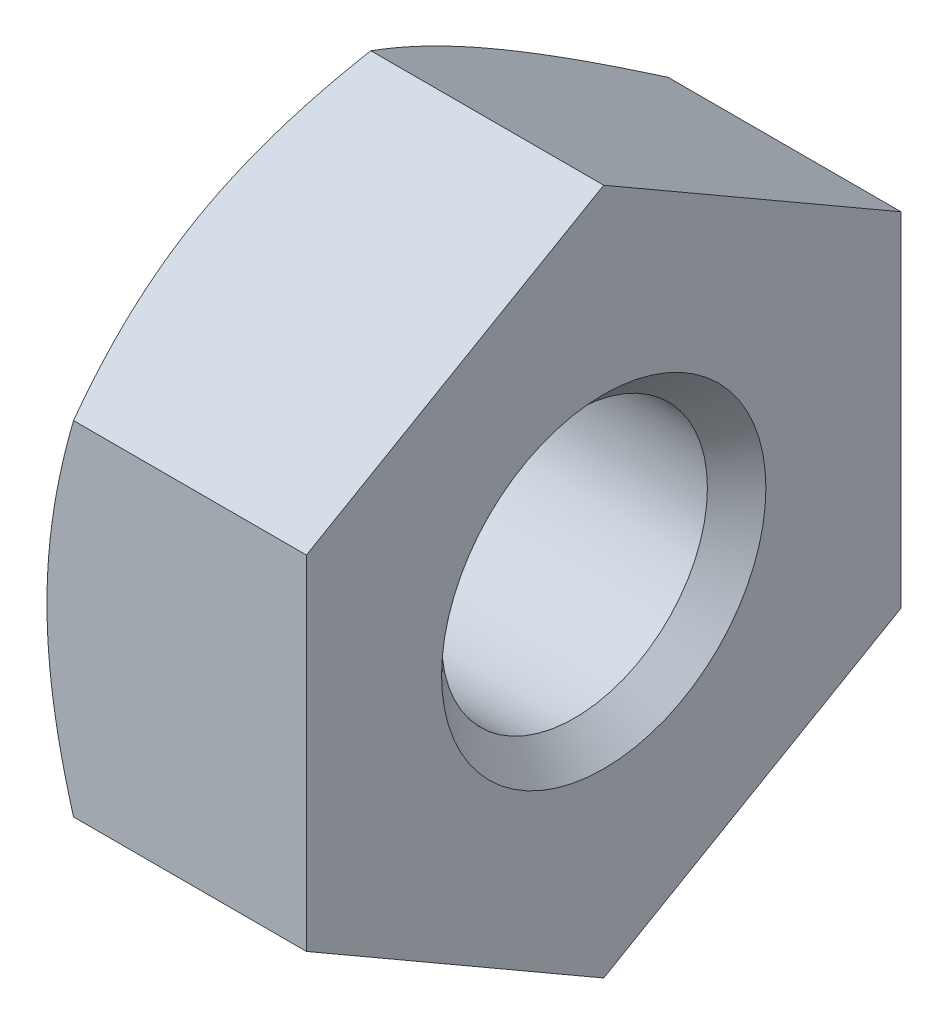
ISO-10303-21;
HEADER;
FILE_DESCRIPTION(('STEP AP214'),'2;1');
FILE_NAME('part.step','',(''),(''),'','','');
FILE_SCHEMA(('AUTOMOTIVE_DESIGN { 1 0 10303 214 1 1 1 1 }'));
ENDSEC;
DATA;
#1=APPLICATION_CONTEXT('core data for automotive mechanical design processes');
#2=APPLICATION_PROTOCOL_DEFINITION('international standard','automotive_design',2000,#1);
#3=PRODUCT_CONTEXT('',#1,'mechanical');
#4=PRODUCT('Part','Part','',(#3));
#5=PRODUCT_RELATED_PRODUCT_CATEGORY('part','',(#4));
#6=PRODUCT_DEFINITION_FORMATION('','',#4);
#7=PRODUCT_DEFINITION_CONTEXT('part definition',#1,'design');
#8=PRODUCT_DEFINITION('design','',#6,#7);
#9=PRODUCT_DEFINITION_SHAPE('','',#8);
#10=(LENGTH_UNIT() NAMED_UNIT(*) SI_UNIT(.MILLI.,.METRE.));
#11=(NAMED_UNIT(*) PLANE_ANGLE_UNIT() SI_UNIT($,.RADIAN.));
#12=(NAMED_UNIT(*) SI_UNIT($,.STERADIAN.) SOLID_ANGLE_UNIT());
#13=UNCERTAINTY_MEASURE_WITH_UNIT(LENGTH_MEASURE(1.E-05),#10,'distance_accuracy_value','');
#14=(GEOMETRIC_REPRESENTATION_CONTEXT(3) GLOBAL_UNCERTAINTY_ASSIGNED_CONTEXT((#13)) GLOBAL_UNIT_ASSIGNED_CONTEXT((#10,
#11,#12)) REPRESENTATION_CONTEXT('',''));
#15=CARTESIAN_POINT('',(0.,0.,0.));
#16=DIRECTION('',(0.,0.,1.));
#17=DIRECTION('',(1.,0.,0.));
#18=AXIS2_PLACEMENT_3D('',#15,#16,#17);
#19=CARTESIAN_POINT('',(-0.94019237886467,0.,0.));
#20=DIRECTION('',(1.,0.,0.));
#21=DIRECTION('',(0.,0.,-1.));
#22=AXIS2_PLACEMENT_3D('',#19,#20,#21);
#23=CONICAL_SURFACE('',#22,3.2,1.0471975511966);
#24=CARTESIAN_POINT('',(0.116899901263427,-4.2128176445144,-2.75));
#25=CARTESIAN_POINT('',(0.0585358150897928,-4.09206175441161,-2.75));
#26=CARTESIAN_POINT('',(0.000751313320708632,-3.97102058026674,-2.75));
#27=CARTESIAN_POINT('',(-0.11332737259427,-3.72821342104705,-2.75));
#28=CARTESIAN_POINT('',(-0.1696212991709,-3.60644731510048,-2.75));
#29=CARTESIAN_POINT('',(-0.280683816081055,-3.3613792497904,-2.75));
#30=CARTESIAN_POINT('',(-0.335441852528569,-3.23807249019038,-2.75));
#31=CARTESIAN_POINT('',(-0.442608769416106,-2.99044622504905,-2.75));
#32=CARTESIAN_POINT('',(-0.495017772139855,-2.86612677262461,-2.75));
#33=CARTESIAN_POINT('',(-0.597488011111556,-2.61472491435786,-2.75));
#34=CARTESIAN_POINT('',(-0.647512255717007,-2.48762734782283,-2.75));
#35=CARTESIAN_POINT('',(-0.743647769013464,-2.23193378863614,-2.75));
#36=CARTESIAN_POINT('',(-0.789758602600039,-2.10333763116981,-2.75));
#37=CARTESIAN_POINT('',(-0.876829746324347,-1.84470576670706,-2.75));
#38=CARTESIAN_POINT('',(-0.917800989357833,-1.71467377834625,-2.75));
#39=CARTESIAN_POINT('',(-0.993263613623143,-1.45276113270948,-2.75));
#40=CARTESIAN_POINT('',(-1.02775704200768,-1.32088107367671,-2.75));
#41=CARTESIAN_POINT('',(-1.08859053449044,-1.05518302145176,-2.75));
#42=CARTESIAN_POINT('',(-1.11492853241768,-0.921364546137669,-2.75));
#43=CARTESIAN_POINT('',(-1.15767953373874,-0.652112000043998,-2.75));
#44=CARTESIAN_POINT('',(-1.17409253050993,-0.51667792818645,-2.75));
#45=CARTESIAN_POINT('',(-1.19554160564382,-0.245762022708423,-2.75));
#46=CARTESIAN_POINT('',(-1.20064991451961,-0.110286056590175,-2.75));
#47=CARTESIAN_POINT('',(-1.1992173554919,0.160574270135581,-2.75));
#48=CARTESIAN_POINT('',(-1.19267952164877,0.295958645412523,-2.75));
#49=CARTESIAN_POINT('',(-1.17203672480029,0.527085181886233,-2.75));
#50=CARTESIAN_POINT('',(-1.16063339729711,0.623082191033736,-2.75));
#51=CARTESIAN_POINT('',(-1.13271188305182,0.81433598480462,-2.75));
#52=CARTESIAN_POINT('',(-1.1161928913043,0.909592650506843,-2.75));
#53=CARTESIAN_POINT('',(-1.059829209834,1.19417377130812,-2.75));
#54=CARTESIAN_POINT('',(-1.01319228175914,1.38216583216315,-2.75));
#55=CARTESIAN_POINT('',(-0.932739470552959,1.66347118298159,-2.75));
#56=CARTESIAN_POINT('',(-0.903761500041856,1.75825036010036,-2.75));
#57=CARTESIAN_POINT('',(-0.842933996229099,1.94681952572579,-2.75));
#58=CARTESIAN_POINT('',(-0.811086441961629,2.04061014688645,-2.75));
#59=CARTESIAN_POINT('',(-0.745182794916507,2.22681002484737,-2.75));
#60=CARTESIAN_POINT('',(-0.711140134891271,2.31922408448834,-2.75));
#61=CARTESIAN_POINT('',(-0.641053990054168,2.50333483778029,-2.75));
#62=CARTESIAN_POINT('',(-0.605009698237786,2.59503122483461,-2.75));
#63=CARTESIAN_POINT('',(-0.568162024521032,2.68639587514905,-2.75));
#64=B_SPLINE_CURVE_WITH_KNOTS('',3,(#24,#25,#26,#27,#28,#29,#30,#31,#32,#33,#34,#35,#36,#37,#38,
#39,#40,#41,#42,#43,#44,#45,#46,#47,#48,#49,#50,#51,#52,#53,#54,#55,#56,#57,#58,#59,#60,#61,#62,
#63),.UNSPECIFIED.,.F.,.F.,(4,2,2,2,2,2,2,2,2,2,2,2,2,2,2,2,2,2,2,4),(0.,0.402367371635709,
0.804803823938379,1.20953982216093,1.61425472649942,2.02396821262994,2.43372719238479,
2.8425991975322,3.2513417705758,3.6601878136146,4.06903412946197,4.47526051498547,
4.88138108563411,5.171255359401,5.46117527123616,6.0414458844777,6.33875257758383,
6.63585577731931,6.9312875346499,7.22683927936249),.UNSPECIFIED.);
#65=CARTESIAN_POINT('',(-1.2,0.,-2.75));
#66=VERTEX_POINT('',#65);
#67=CARTESIAN_POINT('',(-0.95437990693813,-1.5877132402715,-2.75));
#68=VERTEX_POINT('',#67);
#69=EDGE_CURVE('E208',#66,#68,#64,.F.);
#70=ORIENTED_EDGE('',*,*,#69,.T.);
#71=CARTESIAN_POINT('',(-0.954313236635232,-1.58759777021766,-2.7502));
#72=CARTESIAN_POINT('',(-0.99461233775073,-1.65737010029701,-2.62935077934009));
#73=CARTESIAN_POINT('',(-1.03126309740233,-1.72774469983536,-2.50745839737736));
#74=CARTESIAN_POINT('',(-1.0952378170302,-1.86971254687005,-2.2615628732721));
#75=CARTESIAN_POINT('',(-1.1225391443255,-1.94130831721585,-2.13755536142614));
#76=CARTESIAN_POINT('',(-1.16503825470588,-2.083612548896,-1.89107720202404));
#77=CARTESIAN_POINT('',(-1.18051888137754,-2.15429911309865,-1.76864448141257));
#78=CARTESIAN_POINT('',(-1.19900060263006,-2.29600490065924,-1.52320285763107));
#79=CARTESIAN_POINT('',(-1.2020170005374,-2.36702360884404,-1.40019484676707));
#80=CARTESIAN_POINT('',(-1.19574685457146,-2.49972966594897,-1.17034121338919));
#81=CARTESIAN_POINT('',(-1.1879998457233,-2.56143686540072,-1.06346120874596));
#82=CARTESIAN_POINT('',(-1.16344481893565,-2.68444923614045,-0.850397532665236));
#83=CARTESIAN_POINT('',(-1.14662841034944,-2.74575398185006,-0.744214598351098));
#84=CARTESIAN_POINT('',(-1.10458807765406,-2.86902004703204,-0.530711510606808));
#85=CARTESIAN_POINT('',(-1.07918591931279,-2.93096576264316,-0.423418383857138));
#86=CARTESIAN_POINT('',(-1.02153277416004,-3.0539332080613,-0.210432520715946));
#87=CARTESIAN_POINT('',(-0.98929533670104,-3.11495651365991,-0.104737054973346));
#88=CARTESIAN_POINT('',(-0.954313236635265,-3.17554195059674,0.000199999999999926));
#89=B_SPLINE_CURVE_WITH_KNOTS('',3,(#71,#72,#73,#74,#75,#76,#77,#78,#79,#80,#81,#82,#83,#84,#85,
#86,#87,#88),.UNSPECIFIED.,.F.,.F.,(4,2,2,2,2,2,2,2,4),(0.,0.43591282872589,0.872873557116336,
1.29901931904672,1.72464171213574,2.09526089052937,2.46622354066373,2.84541551798555,
3.22386274754521),.UNSPECIFIED.);
#90=CARTESIAN_POINT('',(-1.2,-2.38156986040723,-1.37499999999995));
#91=VERTEX_POINT('',#90);
#92=EDGE_CURVE('E11',#68,#91,#89,.T.);
#93=ORIENTED_EDGE('',*,*,#92,.T.);
#94=CARTESIAN_POINT('',(-1.2,0.,0.));
#95=DIRECTION('',(-1.,0.,0.));
#96=DIRECTION('',(0.,0.,1.));
#97=AXIS2_PLACEMENT_3D('',#94,#95,#96);
#98=CIRCLE('',#97,2.75);
#99=EDGE_CURVE('E254',#66,#91,#98,.T.);
#100=ORIENTED_EDGE('',*,*,#99,.F.);
#101=EDGE_LOOP('',(#70,#93,#100));
#102=FACE_BOUND('',#101,.T.);
#103=ADVANCED_FACE('F35',(#102),#23,.T.);
#104=CARTESIAN_POINT('',(-1.2,-2.38156986040723,1.37499999999995));
#105=VERTEX_POINT('',#104);
#106=EDGE_CURVE('E260',#91,#105,#98,.T.);
#107=ORIENTED_EDGE('',*,*,#106,.F.);
#108=CARTESIAN_POINT('',(-0.954379906938163,-3.1754264805429,0.));
#109=VERTEX_POINT('',#108);
#110=EDGE_CURVE('E39',#91,#109,#89,.T.);
#111=ORIENTED_EDGE('',*,*,#110,.T.);
#112=CARTESIAN_POINT('',(-0.954313236635265,-3.17554195059674,-0.00019999999999989));
#113=CARTESIAN_POINT('',(-0.99461233775076,-3.10576962051739,0.120649220659906));
#114=CARTESIAN_POINT('',(-1.03126309740236,-3.03539502097904,0.242541602622634));
#115=CARTESIAN_POINT('',(-1.09523781703022,-2.89342717394436,0.488437126727893));
#116=CARTESIAN_POINT('',(-1.12253914432552,-2.82183140359856,0.612444638573856));
#117=CARTESIAN_POINT('',(-1.16503825470589,-2.6795271719184,0.858922797975944));
#118=CARTESIAN_POINT('',(-1.18051888137755,-2.60884060771575,0.981355518587418));
#119=CARTESIAN_POINT('',(-1.19900060263007,-2.46713482015518,1.22679714236892));
#120=CARTESIAN_POINT('',(-1.2020170005374,-2.39611611197037,1.34980515323291));
#121=CARTESIAN_POINT('',(-1.19574685457145,-2.26341005486544,1.57965878661079));
#122=CARTESIAN_POINT('',(-1.1879998457233,-2.20170285541369,1.68653879125402));
#123=CARTESIAN_POINT('',(-1.16344481893564,-2.07869048467395,1.89960246733475));
#124=CARTESIAN_POINT('',(-1.14662841034943,-2.01738573896434,2.00578540164889));
#125=CARTESIAN_POINT('',(-1.10458807765404,-1.89411967378236,2.21928848939318));
#126=CARTESIAN_POINT('',(-1.07918591931276,-1.83217395817125,2.32658161614285));
#127=CARTESIAN_POINT('',(-1.02153277416001,-1.7092065127531,2.53956747928405));
#128=CARTESIAN_POINT('',(-0.98929533670101,-1.64818320715449,2.64526294502665));
#129=CARTESIAN_POINT('',(-0.954313236635232,-1.58759777021766,2.7502));
#130=B_SPLINE_CURVE_WITH_KNOTS('',3,(#112,#113,#114,#115,#116,#117,#118,#119,#120,#121,#122,
#123,#124,#125,#126,#127,#128,#129),.UNSPECIFIED.,.F.,.F.,(4,2,2,2,2,2,2,2,4),(0.,
0.435912828725883,0.87287355711632,1.2990193190467,1.72464171213571,2.09526089052935,
2.46622354066371,2.84541551798554,3.22386274754521),.UNSPECIFIED.);
#131=EDGE_CURVE('E217',#109,#105,#130,.T.);
#132=ORIENTED_EDGE('',*,*,#131,.T.);
#133=EDGE_LOOP('',(#107,#111,#132));
#134=FACE_BOUND('',#133,.T.);
#135=ADVANCED_FACE('F243',(#134),#23,.T.);
#136=CARTESIAN_POINT('',(-1.2,0.,2.75));
#137=VERTEX_POINT('',#136);
#138=EDGE_CURVE('E163',#105,#137,#98,.T.);
#139=ORIENTED_EDGE('',*,*,#138,.F.);
#140=CARTESIAN_POINT('',(-0.95437990693813,-1.5877132402715,2.75));
#141=VERTEX_POINT('',#140);
#142=EDGE_CURVE('E206',#105,#141,#130,.T.);
#143=ORIENTED_EDGE('',*,*,#142,.T.);
#144=CARTESIAN_POINT('',(0.116899901263427,-4.2128176445144,2.75));
#145=CARTESIAN_POINT('',(0.0585358150897928,-4.09206175441161,2.75));
#146=CARTESIAN_POINT('',(0.000751313320708632,-3.97102058026674,2.75));
#147=CARTESIAN_POINT('',(-0.11332737259427,-3.72821342104705,2.75));
#148=CARTESIAN_POINT('',(-0.1696212991709,-3.60644731510048,2.75));
#149=CARTESIAN_POINT('',(-0.280683816081055,-3.3613792497904,2.75));
#150=CARTESIAN_POINT('',(-0.335441852528569,-3.23807249019038,2.75));
#151=CARTESIAN_POINT('',(-0.442608769416106,-2.99044622504905,2.75));
#152=CARTESIAN_POINT('',(-0.495017772139855,-2.86612677262461,2.75));
#153=CARTESIAN_POINT('',(-0.597488011111556,-2.61472491435786,2.75));
#154=CARTESIAN_POINT('',(-0.647512255717007,-2.48762734782283,2.75));
#155=CARTESIAN_POINT('',(-0.743647769013464,-2.23193378863614,2.75));
#156=CARTESIAN_POINT('',(-0.789758602600039,-2.10333763116981,2.75));
#157=CARTESIAN_POINT('',(-0.876829746324347,-1.84470576670706,2.75));
#158=CARTESIAN_POINT('',(-0.917800989357833,-1.71467377834625,2.75));
#159=CARTESIAN_POINT('',(-0.993263613623143,-1.45276113270948,2.75));
#160=CARTESIAN_POINT('',(-1.02775704200768,-1.32088107367671,2.75));
#161=CARTESIAN_POINT('',(-1.08859053449044,-1.05518302145176,2.75));
#162=CARTESIAN_POINT('',(-1.11492853241768,-0.921364546137669,2.75));
#163=CARTESIAN_POINT('',(-1.15767953373874,-0.652112000043998,2.75));
#164=CARTESIAN_POINT('',(-1.17409253050993,-0.51667792818645,2.75));
#165=CARTESIAN_POINT('',(-1.19554160564382,-0.245762022708423,2.75));
#166=CARTESIAN_POINT('',(-1.20064991451961,-0.110286056590175,2.75));
#167=CARTESIAN_POINT('',(-1.1992173554919,0.160574270135581,2.75));
#168=CARTESIAN_POINT('',(-1.19267952164877,0.295958645412523,2.75));
#169=CARTESIAN_POINT('',(-1.17203672480029,0.527085181886233,2.75));
#170=CARTESIAN_POINT('',(-1.16063339729711,0.623082191033736,2.75));
#171=CARTESIAN_POINT('',(-1.13271188305182,0.81433598480462,2.75));
#172=CARTESIAN_POINT('',(-1.1161928913043,0.909592650506843,2.75));
#173=CARTESIAN_POINT('',(-1.059829209834,1.19417377130812,2.75));
#174=CARTESIAN_POINT('',(-1.01319228175914,1.38216583216315,2.75));
#175=CARTESIAN_POINT('',(-0.932739470552959,1.66347118298159,2.75));
#176=CARTESIAN_POINT('',(-0.903761500041856,1.75825036010036,2.75));
#177=CARTESIAN_POINT('',(-0.842933996229099,1.94681952572579,2.75));
#178=CARTESIAN_POINT('',(-0.811086441961629,2.04061014688645,2.75));
#179=CARTESIAN_POINT('',(-0.745182794916507,2.22681002484737,2.75));
#180=CARTESIAN_POINT('',(-0.711140134891271,2.31922408448834,2.75));
#181=CARTESIAN_POINT('',(-0.641053990054168,2.50333483778029,2.75));
#182=CARTESIAN_POINT('',(-0.605009698237786,2.59503122483461,2.75));
#183=CARTESIAN_POINT('',(-0.568162024521032,2.68639587514905,2.75));
#184=B_SPLINE_CURVE_WITH_KNOTS('',3,(#144,#145,#146,#147,#148,#149,#150,#151,#152,#153,#154,
#155,#156,#157,#158,#159,#160,#161,#162,#163,#164,#165,#166,#167,#168,#169,#170,#171,#172,#173,
#174,#175,#176,#177,#178,#179,#180,#181,#182,#183),.UNSPECIFIED.,.F.,.F.,(4,2,2,2,2,2,2,2,2,2,2,
2,2,2,2,2,2,2,2,4),(0.,0.402367371635709,0.804803823938379,1.20953982216093,1.61425472649942,
2.02396821262994,2.43372719238479,2.8425991975322,3.2513417705758,3.6601878136146,
4.06903412946197,4.47526051498547,4.88138108563411,5.171255359401,5.46117527123616,
6.0414458844777,6.33875257758383,6.63585577731931,6.9312875346499,7.22683927936249),.UNSPECIFIED.);
#185=EDGE_CURVE('E113',#141,#137,#184,.T.);
#186=ORIENTED_EDGE('',*,*,#185,.T.);
#187=EDGE_LOOP('',(#139,#143,#186));
#188=FACE_BOUND('',#187,.T.);
#189=ADVANCED_FACE('F248',(#188),#23,.T.);
#190=CARTESIAN_POINT('',(-0.954313236635265,3.17554195059674,0.00019999999999989));
#191=CARTESIAN_POINT('',(-0.99461233775076,3.10576962051739,-0.120649220659906));
#192=CARTESIAN_POINT('',(-1.03126309740236,3.03539502097904,-0.242541602622634));
#193=CARTESIAN_POINT('',(-1.09523781703022,2.89342717394436,-0.488437126727893));
#194=CARTESIAN_POINT('',(-1.12253914432552,2.82183140359856,-0.612444638573856));
#195=CARTESIAN_POINT('',(-1.16503825470589,2.6795271719184,-0.858922797975944));
#196=CARTESIAN_POINT('',(-1.18051888137755,2.60884060771575,-0.981355518587418));
#197=CARTESIAN_POINT('',(-1.19900060263007,2.46713482015518,-1.22679714236892));
#198=CARTESIAN_POINT('',(-1.2020170005374,2.39611611197037,-1.34980515323291));
#199=CARTESIAN_POINT('',(-1.19574685457145,2.26341005486544,-1.57965878661079));
#200=CARTESIAN_POINT('',(-1.1879998457233,2.20170285541369,-1.68653879125402));
#201=CARTESIAN_POINT('',(-1.16344481893564,2.07869048467395,-1.89960246733475));
#202=CARTESIAN_POINT('',(-1.14662841034943,2.01738573896434,-2.00578540164889));
#203=CARTESIAN_POINT('',(-1.10458807765404,1.89411967378236,-2.21928848939318));
#204=CARTESIAN_POINT('',(-1.07918591931276,1.83217395817125,-2.32658161614285));
#205=CARTESIAN_POINT('',(-1.02153277416001,1.7092065127531,-2.53956747928405));
#206=CARTESIAN_POINT('',(-0.98929533670101,1.64818320715449,-2.64526294502665));
#207=CARTESIAN_POINT('',(-0.954313236635232,1.58759777021766,-2.7502));
#208=B_SPLINE_CURVE_WITH_KNOTS('',3,(#190,#191,#192,#193,#194,#195,#196,#197,#198,#199,#200,
#201,#202,#203,#204,#205,#206,#207),.UNSPECIFIED.,.F.,.F.,(4,2,2,2,2,2,2,2,4),(0.,
0.435912828725883,0.87287355711632,1.2990193190467,1.72464171213571,2.09526089052935,
2.46622354066371,2.84541551798554,3.22386274754521),.UNSPECIFIED.);
#209=CARTESIAN_POINT('',(-1.2,2.38156986040723,-1.37499999999995));
#210=VERTEX_POINT('',#209);
#211=CARTESIAN_POINT('',(-0.95437990693813,1.5877132402715,-2.75));
#212=VERTEX_POINT('',#211);
#213=EDGE_CURVE('E207',#210,#212,#208,.T.);
#214=ORIENTED_EDGE('',*,*,#213,.T.);
#215=EDGE_CURVE('E201',#212,#66,#64,.F.);
#216=ORIENTED_EDGE('',*,*,#215,.T.);
#217=EDGE_CURVE('E265',#210,#66,#98,.T.);
#218=ORIENTED_EDGE('',*,*,#217,.F.);
#219=EDGE_LOOP('',(#214,#216,#218));
#220=FACE_BOUND('',#219,.T.);
#221=ADVANCED_FACE('F272',(#220),#23,.T.);
#222=CARTESIAN_POINT('',(-1.2,2.38156986040723,1.37499999999995));
#223=VERTEX_POINT('',#222);
#224=EDGE_CURVE('E164',#137,#223,#98,.T.);
#225=ORIENTED_EDGE('',*,*,#224,.F.);
#226=CARTESIAN_POINT('',(-0.95437990693813,1.5877132402715,2.75));
#227=VERTEX_POINT('',#226);
#228=EDGE_CURVE('E209',#137,#227,#184,.T.);
#229=ORIENTED_EDGE('',*,*,#228,.T.);
#230=CARTESIAN_POINT('',(-0.954313236635232,1.58759777021766,2.7502));
#231=CARTESIAN_POINT('',(-0.99461233775073,1.65737010029701,2.62935077934009));
#232=CARTESIAN_POINT('',(-1.03126309740233,1.72774469983536,2.50745839737736));
#233=CARTESIAN_POINT('',(-1.0952378170302,1.86971254687005,2.2615628732721));
#234=CARTESIAN_POINT('',(-1.1225391443255,1.94130831721585,2.13755536142614));
#235=CARTESIAN_POINT('',(-1.16503825470588,2.083612548896,1.89107720202404));
#236=CARTESIAN_POINT('',(-1.18051888137754,2.15429911309865,1.76864448141257));
#237=CARTESIAN_POINT('',(-1.19900060263006,2.29600490065924,1.52320285763107));
#238=CARTESIAN_POINT('',(-1.2020170005374,2.36702360884404,1.40019484676707));
#239=CARTESIAN_POINT('',(-1.19574685457146,2.49972966594897,1.17034121338919));
#240=CARTESIAN_POINT('',(-1.1879998457233,2.56143686540072,1.06346120874596));
#241=CARTESIAN_POINT('',(-1.16344481893565,2.68444923614045,0.850397532665236));
#242=CARTESIAN_POINT('',(-1.14662841034944,2.74575398185006,0.744214598351098));
#243=CARTESIAN_POINT('',(-1.10458807765406,2.86902004703204,0.530711510606808));
#244=CARTESIAN_POINT('',(-1.07918591931279,2.93096576264316,0.423418383857138));
#245=CARTESIAN_POINT('',(-1.02153277416004,3.0539332080613,0.210432520715946));
#246=CARTESIAN_POINT('',(-0.98929533670104,3.11495651365991,0.104737054973346));
#247=CARTESIAN_POINT('',(-0.954313236635265,3.17554195059674,-0.000199999999999926));
#248=B_SPLINE_CURVE_WITH_KNOTS('',3,(#230,#231,#232,#233,#234,#235,#236,#237,#238,#239,#240,
#241,#242,#243,#244,#245,#246,#247),.UNSPECIFIED.,.F.,.F.,(4,2,2,2,2,2,2,2,4),(0.,
0.43591282872589,0.872873557116336,1.29901931904672,1.72464171213574,2.09526089052937,
2.46622354066373,2.84541551798555,3.22386274754521),.UNSPECIFIED.);
#249=EDGE_CURVE('E175',#227,#223,#248,.T.);
#250=ORIENTED_EDGE('',*,*,#249,.T.);
#251=EDGE_LOOP('',(#225,#229,#250));
#252=FACE_BOUND('',#251,.T.);
#253=ADVANCED_FACE('F240',(#252),#23,.T.);
#254=CARTESIAN_POINT('',(-1.2,0.,0.));
#255=DIRECTION('',(1.,0.,0.));
#256=DIRECTION('',(0.,0.,-1.));
#257=AXIS2_PLACEMENT_3D('',#254,#255,#256);
#258=PLANE('',#257);
#259=ORIENTED_EDGE('',*,*,#224,.T.);
#260=EDGE_CURVE('E168',#223,#210,#98,.T.);
#261=ORIENTED_EDGE('',*,*,#260,.T.);
#262=ORIENTED_EDGE('',*,*,#217,.T.);
#263=ORIENTED_EDGE('',*,*,#99,.T.);
#264=ORIENTED_EDGE('',*,*,#106,.T.);
#265=ORIENTED_EDGE('',*,*,#138,.T.);
#266=EDGE_LOOP('',(#259,#261,#262,#263,#264,#265));
#267=FACE_BOUND('',#266,.T.);
#268=CARTESIAN_POINT('',(-1.2,0.,0.));
#269=DIRECTION('',(-1.,0.,0.));
#270=DIRECTION('',(0.,0.,1.));
#271=AXIS2_PLACEMENT_3D('',#268,#269,#270);
#272=CIRCLE('',#271,1.5);
#273=CARTESIAN_POINT('',(-1.2,0.,1.5));
#274=VERTEX_POINT('',#273);
#275=EDGE_CURVE('E160',#274,#274,#272,.T.);
#276=ORIENTED_EDGE('',*,*,#275,.F.);
#277=EDGE_LOOP('',(#276));
#278=FACE_BOUND('',#277,.T.);
#279=ADVANCED_FACE('F37',(#267,#278),#258,.F.);
#280=CARTESIAN_POINT('',(1.2,3.2,0.));
#281=DIRECTION('',(-1.,0.,0.));
#282=DIRECTION('',(0.,0.,1.));
#283=AXIS2_PLACEMENT_3D('',#280,#281,#282);
#284=PLANE('',#283);
#285=DIRECTION('',(0.,-0.499999999999983,0.866025403784448));
#286=VECTOR('',#285,1.);
#287=CARTESIAN_POINT('',(1.2,3.1754264805429,0.));
#288=LINE('',#287,#286);
#289=CARTESIAN_POINT('',(1.2,3.1754264805429,0.));
#290=VERTEX_POINT('',#289);
#291=CARTESIAN_POINT('',(1.2,1.5877132402715,2.75));
#292=VERTEX_POINT('',#291);
#293=EDGE_CURVE('E132',#290,#292,#288,.T.);
#294=ORIENTED_EDGE('',*,*,#293,.T.);
#295=DIRECTION('',(0.,-1.,0.));
#296=VECTOR('',#295,1.);
#297=CARTESIAN_POINT('',(1.2,1.5877132402715,2.75));
#298=LINE('',#297,#296);
#299=CARTESIAN_POINT('',(1.2,-1.5877132402715,2.75));
#300=VERTEX_POINT('',#299);
#301=EDGE_CURVE('E54',#292,#300,#298,.T.);
#302=ORIENTED_EDGE('',*,*,#301,.T.);
#303=DIRECTION('',(0.,-0.499999999999983,-0.866025403784448));
#304=VECTOR('',#303,1.);
#305=CARTESIAN_POINT('',(1.2,-1.5877132402715,2.75));
#306=LINE('',#305,#304);
#307=CARTESIAN_POINT('',(1.2,-3.1754264805429,0.));
#308=VERTEX_POINT('',#307);
#309=EDGE_CURVE('E120',#300,#308,#306,.T.);
#310=ORIENTED_EDGE('',*,*,#309,.T.);
#311=DIRECTION('',(0.,0.499999999999983,-0.866025403784448));
#312=VECTOR('',#311,1.);
#313=CARTESIAN_POINT('',(1.2,-3.1754264805429,0.));
#314=LINE('',#313,#312);
#315=CARTESIAN_POINT('',(1.2,-1.5877132402715,-2.75));
#316=VERTEX_POINT('',#315);
#317=EDGE_CURVE('E126',#308,#316,#314,.T.);
#318=ORIENTED_EDGE('',*,*,#317,.T.);
#319=DIRECTION('',(0.,1.,0.));
#320=VECTOR('',#319,1.);
#321=CARTESIAN_POINT('',(1.2,-1.5877132402715,-2.75));
#322=LINE('',#321,#320);
#323=CARTESIAN_POINT('',(1.2,1.5877132402715,-2.75));
#324=VERTEX_POINT('',#323);
#325=EDGE_CURVE('E136',#316,#324,#322,.T.);
#326=ORIENTED_EDGE('',*,*,#325,.T.);
#327=DIRECTION('',(0.,0.499999999999983,0.866025403784448));
#328=VECTOR('',#327,1.);
#329=CARTESIAN_POINT('',(1.2,1.5877132402715,-2.75));
#330=LINE('',#329,#328);
#331=EDGE_CURVE('E139',#324,#290,#330,.T.);
#332=ORIENTED_EDGE('',*,*,#331,.T.);
#333=EDGE_LOOP('',(#294,#302,#310,#318,#326,#332));
#334=FACE_BOUND('',#333,.T.);
#335=CARTESIAN_POINT('',(1.2,0.,0.));
#336=DIRECTION('',(-1.,0.,0.));
#337=DIRECTION('',(0.,0.,1.));
#338=AXIS2_PLACEMENT_3D('',#335,#336,#337);
#339=CIRCLE('',#338,1.5);
#340=CARTESIAN_POINT('',(1.2,0.,1.5));
#341=VERTEX_POINT('',#340);
#342=EDGE_CURVE('E116',#341,#341,#339,.T.);
#343=ORIENTED_EDGE('',*,*,#342,.T.);
#344=EDGE_LOOP('',(#343));
#345=FACE_BOUND('',#344,.T.);
#346=ADVANCED_FACE('F129',(#334,#345),#284,.F.);
#347=CARTESIAN_POINT('',(-0.954379906938163,3.1754264805429,0.));
#348=VERTEX_POINT('',#347);
#349=EDGE_CURVE('E167',#223,#348,#248,.T.);
#350=ORIENTED_EDGE('',*,*,#349,.T.);
#351=EDGE_CURVE('E176',#348,#210,#208,.T.);
#352=ORIENTED_EDGE('',*,*,#351,.T.);
#353=ORIENTED_EDGE('',*,*,#260,.F.);
#354=EDGE_LOOP('',(#350,#352,#353));
#355=FACE_BOUND('',#354,.T.);
#356=ADVANCED_FACE('F182',(#355),#23,.T.);
#357=CARTESIAN_POINT('',(-0.9295,0.,0.));
#358=DIRECTION('',(-1.,0.,0.));
#359=DIRECTION('',(0.,0.,1.));
#360=AXIS2_PLACEMENT_3D('',#357,#358,#359);
#361=CONICAL_SURFACE('',#360,1.2295,0.785398163397449);
#362=ORIENTED_EDGE('',*,*,#275,.T.);
#363=EDGE_LOOP('',(#362));
#364=FACE_BOUND('',#363,.T.);
#365=CARTESIAN_POINT('',(-0.9295,0.,0.));
#366=DIRECTION('',(-1.,0.,0.));
#367=DIRECTION('',(0.,0.,1.));
#368=AXIS2_PLACEMENT_3D('',#365,#366,#367);
#369=CIRCLE('',#368,1.2295);
#370=CARTESIAN_POINT('',(-0.9295,0.,1.2295));
#371=VERTEX_POINT('',#370);
#372=EDGE_CURVE('E157',#371,#371,#369,.T.);
#373=ORIENTED_EDGE('',*,*,#372,.F.);
#374=EDGE_LOOP('',(#373));
#375=FACE_BOUND('',#374,.T.);
#376=ADVANCED_FACE('F230',(#364,#375),#361,.F.);
#377=CARTESIAN_POINT('',(1.2,0.,0.));
#378=DIRECTION('',(-1.,0.,0.));
#379=DIRECTION('',(0.,0.,1.));
#380=AXIS2_PLACEMENT_3D('',#377,#378,#379);
#381=CYLINDRICAL_SURFACE('',#380,1.2295);
#382=ORIENTED_EDGE('',*,*,#372,.T.);
#383=EDGE_LOOP('',(#382));
#384=FACE_BOUND('',#383,.T.);
#385=CARTESIAN_POINT('',(0.9295,0.,0.));
#386=DIRECTION('',(-1.,0.,0.));
#387=DIRECTION('',(0.,0.,1.));
#388=AXIS2_PLACEMENT_3D('',#385,#386,#387);
#389=CIRCLE('',#388,1.2295);
#390=CARTESIAN_POINT('',(0.9295,0.,1.2295));
#391=VERTEX_POINT('',#390);
#392=EDGE_CURVE('E154',#391,#391,#389,.T.);
#393=ORIENTED_EDGE('',*,*,#392,.F.);
#394=EDGE_LOOP('',(#393));
#395=FACE_BOUND('',#394,.T.);
#396=ADVANCED_FACE('F226',(#384,#395),#381,.F.);
#397=CARTESIAN_POINT('',(1.2,0.,0.));
#398=DIRECTION('',(1.,0.,0.));
#399=DIRECTION('',(0.,0.,-1.));
#400=AXIS2_PLACEMENT_3D('',#397,#398,#399);
#401=CONICAL_SURFACE('',#400,1.5,0.785398163397449);
#402=ORIENTED_EDGE('',*,*,#392,.T.);
#403=EDGE_LOOP('',(#402));
#404=FACE_BOUND('',#403,.T.);
#405=ORIENTED_EDGE('',*,*,#342,.F.);
#406=EDGE_LOOP('',(#405));
#407=FACE_BOUND('',#406,.T.);
#408=ADVANCED_FACE('F223',(#404,#407),#401,.F.);
#409=CARTESIAN_POINT('',(1.2,1.5877132402715,2.75));
#410=DIRECTION('',(0.,0.,-1.));
#411=DIRECTION('',(-1.,0.,0.));
#412=AXIS2_PLACEMENT_3D('',#409,#410,#411);
#413=PLANE('',#412);
#414=DIRECTION('',(-1.,0.,0.));
#415=VECTOR('',#414,1.);
#416=CARTESIAN_POINT('',(1.2,-1.5877132402715,2.75));
#417=LINE('',#416,#415);
#418=EDGE_CURVE('E109',#300,#141,#417,.T.);
#419=ORIENTED_EDGE('',*,*,#418,.F.);
#420=ORIENTED_EDGE('',*,*,#301,.F.);
#421=DIRECTION('',(-1.,0.,0.));
#422=VECTOR('',#421,1.);
#423=CARTESIAN_POINT('',(1.2,1.5877132402715,2.75));
#424=LINE('',#423,#422);
#425=EDGE_CURVE('E142',#292,#227,#424,.T.);
#426=ORIENTED_EDGE('',*,*,#425,.T.);
#427=ORIENTED_EDGE('',*,*,#228,.F.);
#428=ORIENTED_EDGE('',*,*,#185,.F.);
#429=EDGE_LOOP('',(#419,#420,#426,#427,#428));
#430=FACE_BOUND('',#429,.T.);
#431=ADVANCED_FACE('F111',(#430),#413,.F.);
#432=CARTESIAN_POINT('',(1.2,-1.5877132402715,2.75));
#433=DIRECTION('',(0.,0.866025403784448,-0.499999999999983));
#434=DIRECTION('',(0.,0.499999999999983,0.866025403784448));
#435=AXIS2_PLACEMENT_3D('',#432,#433,#434);
#436=PLANE('',#435);
#437=DIRECTION('',(-1.,0.,0.));
#438=VECTOR('',#437,1.);
#439=CARTESIAN_POINT('',(1.2,-3.1754264805429,0.));
#440=LINE('',#439,#438);
#441=EDGE_CURVE('E117',#308,#109,#440,.T.);
#442=ORIENTED_EDGE('',*,*,#441,.F.);
#443=ORIENTED_EDGE('',*,*,#309,.F.);
#444=ORIENTED_EDGE('',*,*,#418,.T.);
#445=ORIENTED_EDGE('',*,*,#142,.F.);
#446=ORIENTED_EDGE('',*,*,#131,.F.);
#447=EDGE_LOOP('',(#442,#443,#444,#445,#446));
#448=FACE_BOUND('',#447,.T.);
#449=ADVANCED_FACE('F121',(#448),#436,.F.);
#450=CARTESIAN_POINT('',(1.2,-3.1754264805429,0.));
#451=DIRECTION('',(0.,0.866025403784448,0.499999999999983));
#452=DIRECTION('',(0.,-0.499999999999983,0.866025403784448));
#453=AXIS2_PLACEMENT_3D('',#450,#451,#452);
#454=PLANE('',#453);
#455=DIRECTION('',(-1.,0.,0.));
#456=VECTOR('',#455,1.);
#457=CARTESIAN_POINT('',(1.2,-1.5877132402715,-2.75));
#458=LINE('',#457,#456);
#459=EDGE_CURVE('E148',#316,#68,#458,.T.);
#460=ORIENTED_EDGE('',*,*,#459,.F.);
#461=ORIENTED_EDGE('',*,*,#317,.F.);
#462=ORIENTED_EDGE('',*,*,#441,.T.);
#463=ORIENTED_EDGE('',*,*,#110,.F.);
#464=ORIENTED_EDGE('',*,*,#92,.F.);
#465=EDGE_LOOP('',(#460,#461,#462,#463,#464));
#466=FACE_BOUND('',#465,.T.);
#467=ADVANCED_FACE('F196',(#466),#454,.F.);
#468=CARTESIAN_POINT('',(1.2,-1.5877132402715,-2.75));
#469=DIRECTION('',(0.,0.,1.));
#470=DIRECTION('',(1.,0.,0.));
#471=AXIS2_PLACEMENT_3D('',#468,#469,#470);
#472=PLANE('',#471);
#473=DIRECTION('',(-1.,0.,0.));
#474=VECTOR('',#473,1.);
#475=CARTESIAN_POINT('',(1.2,1.5877132402715,-2.75));
#476=LINE('',#475,#474);
#477=EDGE_CURVE('E145',#324,#212,#476,.T.);
#478=ORIENTED_EDGE('',*,*,#477,.F.);
#479=ORIENTED_EDGE('',*,*,#325,.F.);
#480=ORIENTED_EDGE('',*,*,#459,.T.);
#481=ORIENTED_EDGE('',*,*,#69,.F.);
#482=ORIENTED_EDGE('',*,*,#215,.F.);
#483=EDGE_LOOP('',(#478,#479,#480,#481,#482));
#484=FACE_BOUND('',#483,.T.);
#485=ADVANCED_FACE('F192',(#484),#472,.F.);
#486=CARTESIAN_POINT('',(1.2,1.5877132402715,-2.75));
#487=DIRECTION('',(0.,-0.866025403784448,0.499999999999983));
#488=DIRECTION('',(0.,-0.499999999999983,-0.866025403784448));
#489=AXIS2_PLACEMENT_3D('',#486,#487,#488);
#490=PLANE('',#489);
#491=DIRECTION('',(-1.,0.,0.));
#492=VECTOR('',#491,1.);
#493=CARTESIAN_POINT('',(1.2,3.1754264805429,0.));
#494=LINE('',#493,#492);
#495=EDGE_CURVE('E62',#290,#348,#494,.T.);
#496=ORIENTED_EDGE('',*,*,#495,.F.);
#497=ORIENTED_EDGE('',*,*,#331,.F.);
#498=ORIENTED_EDGE('',*,*,#477,.T.);
#499=ORIENTED_EDGE('',*,*,#213,.F.);
#500=ORIENTED_EDGE('',*,*,#351,.F.);
#501=EDGE_LOOP('',(#496,#497,#498,#499,#500));
#502=FACE_BOUND('',#501,.T.);
#503=ADVANCED_FACE('F188',(#502),#490,.F.);
#504=CARTESIAN_POINT('',(1.2,3.1754264805429,0.));
#505=DIRECTION('',(0.,-0.866025403784448,-0.499999999999983));
#506=DIRECTION('',(0.,0.499999999999983,-0.866025403784448));
#507=AXIS2_PLACEMENT_3D('',#504,#505,#506);
#508=PLANE('',#507);
#509=ORIENTED_EDGE('',*,*,#425,.F.);
#510=ORIENTED_EDGE('',*,*,#293,.F.);
#511=ORIENTED_EDGE('',*,*,#495,.T.);
#512=ORIENTED_EDGE('',*,*,#349,.F.);
#513=ORIENTED_EDGE('',*,*,#249,.F.);
#514=EDGE_LOOP('',(#509,#510,#511,#512,#513));
#515=FACE_BOUND('',#514,.T.);
#516=ADVANCED_FACE('F185',(#515),#508,.F.);
#517=CLOSED_SHELL('',(#103,#135,#189,#221,#253,#279,#346,#356,#376,#396,#408,#431,#449,#467,
#485,#503,#516));
#518=MANIFOLD_SOLID_BREP('B2',#517);
#519=ADVANCED_BREP_SHAPE_REPRESENTATION('',(#18,#518),#14);
#520=SHAPE_DEFINITION_REPRESENTATION(#9,#519);
ENDSEC;
END-ISO-10303-21;
